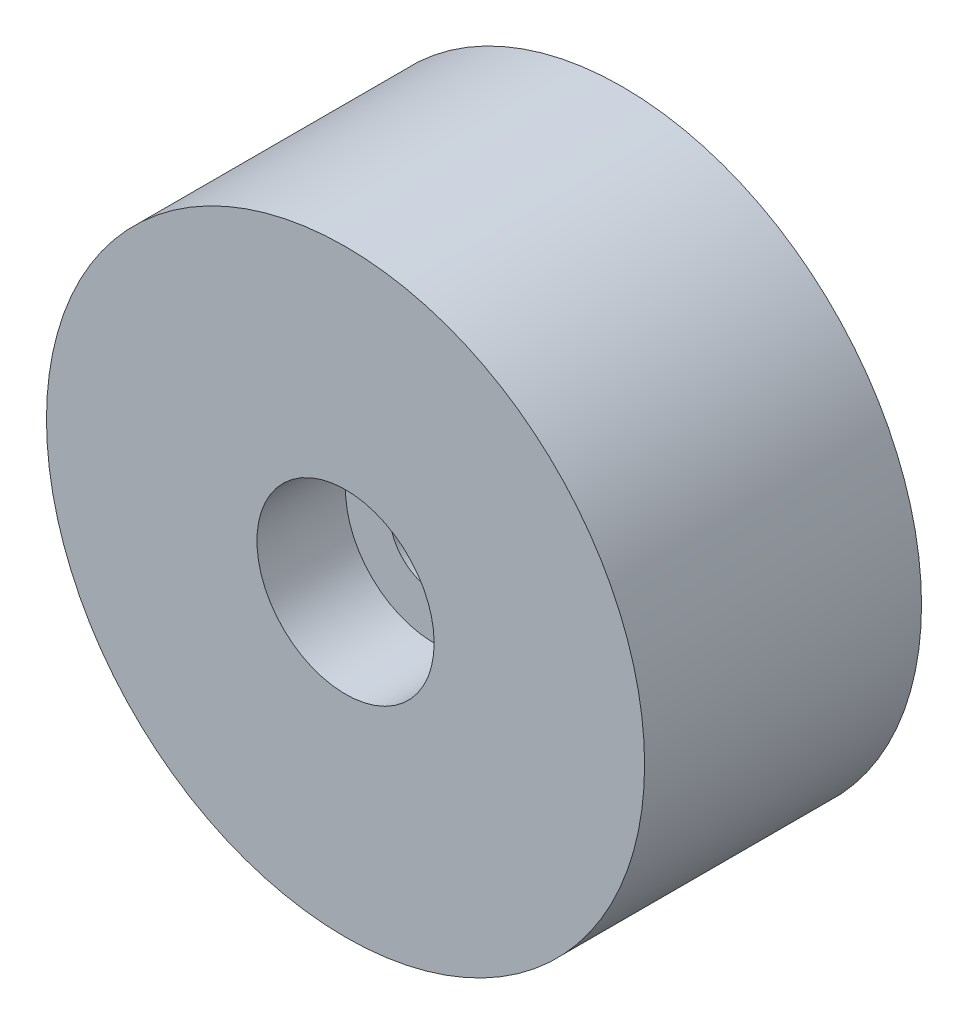
ISO-10303-21;
HEADER;
FILE_DESCRIPTION(('STEP AP214'),'2;1');
FILE_NAME('part.step','',(''),(''),'','','');
FILE_SCHEMA(('AUTOMOTIVE_DESIGN { 1 0 10303 214 1 1 1 1 }'));
ENDSEC;
DATA;
#1=APPLICATION_CONTEXT('core data for automotive mechanical design processes');
#2=APPLICATION_PROTOCOL_DEFINITION('international standard','automotive_design',2000,#1);
#3=PRODUCT_CONTEXT('',#1,'mechanical');
#4=PRODUCT('Part','Part','',(#3));
#5=PRODUCT_RELATED_PRODUCT_CATEGORY('part','',(#4));
#6=PRODUCT_DEFINITION_FORMATION('','',#4);
#7=PRODUCT_DEFINITION_CONTEXT('part definition',#1,'design');
#8=PRODUCT_DEFINITION('design','',#6,#7);
#9=PRODUCT_DEFINITION_SHAPE('','',#8);
#10=(LENGTH_UNIT() NAMED_UNIT(*) SI_UNIT(.MILLI.,.METRE.));
#11=(NAMED_UNIT(*) PLANE_ANGLE_UNIT() SI_UNIT($,.RADIAN.));
#12=(NAMED_UNIT(*) SI_UNIT($,.STERADIAN.) SOLID_ANGLE_UNIT());
#13=UNCERTAINTY_MEASURE_WITH_UNIT(LENGTH_MEASURE(1.E-05),#10,'distance_accuracy_value','');
#14=(GEOMETRIC_REPRESENTATION_CONTEXT(3) GLOBAL_UNCERTAINTY_ASSIGNED_CONTEXT((#13)) GLOBAL_UNIT_ASSIGNED_CONTEXT((#10,
#11,#12)) REPRESENTATION_CONTEXT('',''));
#15=CARTESIAN_POINT('',(0.,0.,0.));
#16=DIRECTION('',(0.,0.,1.));
#17=DIRECTION('',(1.,0.,0.));
#18=AXIS2_PLACEMENT_3D('',#15,#16,#17);
#19=CARTESIAN_POINT('',(0.,0.,25.));
#20=DIRECTION('',(0.,0.,-1.));
#21=DIRECTION('',(-1.,0.,0.));
#22=AXIS2_PLACEMENT_3D('',#19,#20,#21);
#23=CYLINDRICAL_SURFACE('',#22,27.);
#24=CARTESIAN_POINT('',(0.,0.,25.));
#25=DIRECTION('',(0.,0.,1.));
#26=DIRECTION('',(1.,0.,0.));
#27=AXIS2_PLACEMENT_3D('',#24,#25,#26);
#28=CIRCLE('',#27,27.);
#29=CARTESIAN_POINT('',(27.,0.,25.));
#30=VERTEX_POINT('',#29);
#31=EDGE_CURVE('E10',#30,#30,#28,.T.);
#32=ORIENTED_EDGE('',*,*,#31,.F.);
#33=EDGE_LOOP('',(#32));
#34=FACE_BOUND('',#33,.T.);
#35=CARTESIAN_POINT('',(0.,0.,0.));
#36=DIRECTION('',(0.,0.,1.));
#37=DIRECTION('',(1.,0.,0.));
#38=AXIS2_PLACEMENT_3D('',#35,#36,#37);
#39=CIRCLE('',#38,27.);
#40=CARTESIAN_POINT('',(27.,0.,0.));
#41=VERTEX_POINT('',#40);
#42=EDGE_CURVE('E33',#41,#41,#39,.T.);
#43=ORIENTED_EDGE('',*,*,#42,.T.);
#44=EDGE_LOOP('',(#43));
#45=FACE_BOUND('',#44,.T.);
#46=ADVANCED_FACE('F30',(#34,#45),#23,.T.);
#47=CARTESIAN_POINT('',(0.,0.,25.));
#48=DIRECTION('',(0.,0.,1.));
#49=DIRECTION('',(1.,0.,0.));
#50=AXIS2_PLACEMENT_3D('',#47,#48,#49);
#51=PLANE('',#50);
#52=CARTESIAN_POINT('',(0.,0.,25.));
#53=DIRECTION('',(0.,0.,1.));
#54=DIRECTION('',(1.,0.,0.));
#55=AXIS2_PLACEMENT_3D('',#52,#53,#54);
#56=CIRCLE('',#55,8.);
#57=CARTESIAN_POINT('',(8.,0.,25.));
#58=VERTEX_POINT('',#57);
#59=EDGE_CURVE('E42',#58,#58,#56,.T.);
#60=ORIENTED_EDGE('',*,*,#59,.F.);
#61=EDGE_LOOP('',(#60));
#62=FACE_BOUND('',#61,.T.);
#63=ORIENTED_EDGE('',*,*,#31,.T.);
#64=EDGE_LOOP('',(#63));
#65=FACE_BOUND('',#64,.T.);
#66=ADVANCED_FACE('F75',(#62,#65),#51,.T.);
#67=CARTESIAN_POINT('',(0.,0.,0.));
#68=DIRECTION('',(0.,0.,1.));
#69=DIRECTION('',(1.,0.,0.));
#70=AXIS2_PLACEMENT_3D('',#67,#68,#69);
#71=PLANE('',#70);
#72=CARTESIAN_POINT('',(0.,0.,0.));
#73=DIRECTION('',(0.,0.,1.));
#74=DIRECTION('',(1.,0.,0.));
#75=AXIS2_PLACEMENT_3D('',#72,#73,#74);
#76=CIRCLE('',#75,4.);
#77=CARTESIAN_POINT('',(4.,0.,0.));
#78=VERTEX_POINT('',#77);
#79=EDGE_CURVE('E45',#78,#78,#76,.T.);
#80=ORIENTED_EDGE('',*,*,#79,.T.);
#81=EDGE_LOOP('',(#80));
#82=FACE_BOUND('',#81,.T.);
#83=ORIENTED_EDGE('',*,*,#42,.F.);
#84=EDGE_LOOP('',(#83));
#85=FACE_BOUND('',#84,.T.);
#86=ADVANCED_FACE('F54',(#82,#85),#71,.F.);
#87=CARTESIAN_POINT('',(0.,0.,17.));
#88=DIRECTION('',(0.,0.,1.));
#89=DIRECTION('',(1.,0.,0.));
#90=AXIS2_PLACEMENT_3D('',#87,#88,#89);
#91=CYLINDRICAL_SURFACE('',#90,8.);
#92=CARTESIAN_POINT('',(0.,0.,17.));
#93=DIRECTION('',(0.,0.,1.));
#94=DIRECTION('',(1.,0.,0.));
#95=AXIS2_PLACEMENT_3D('',#92,#93,#94);
#96=CIRCLE('',#95,8.);
#97=CARTESIAN_POINT('',(8.,0.,17.));
#98=VERTEX_POINT('',#97);
#99=EDGE_CURVE('E40',#98,#98,#96,.T.);
#100=ORIENTED_EDGE('',*,*,#99,.F.);
#101=EDGE_LOOP('',(#100));
#102=FACE_BOUND('',#101,.T.);
#103=ORIENTED_EDGE('',*,*,#59,.T.);
#104=EDGE_LOOP('',(#103));
#105=FACE_BOUND('',#104,.T.);
#106=ADVANCED_FACE('F66',(#102,#105),#91,.F.);
#107=CARTESIAN_POINT('',(0.,0.,17.));
#108=DIRECTION('',(0.,0.,1.));
#109=DIRECTION('',(1.,0.,0.));
#110=AXIS2_PLACEMENT_3D('',#107,#108,#109);
#111=PLANE('',#110);
#112=CARTESIAN_POINT('',(0.,0.,17.));
#113=DIRECTION('',(0.,0.,1.));
#114=DIRECTION('',(1.,0.,0.));
#115=AXIS2_PLACEMENT_3D('',#112,#113,#114);
#116=CIRCLE('',#115,4.);
#117=CARTESIAN_POINT('',(4.,0.,17.));
#118=VERTEX_POINT('',#117);
#119=EDGE_CURVE('E48',#118,#118,#116,.T.);
#120=ORIENTED_EDGE('',*,*,#119,.F.);
#121=EDGE_LOOP('',(#120));
#122=FACE_BOUND('',#121,.T.);
#123=ORIENTED_EDGE('',*,*,#99,.T.);
#124=EDGE_LOOP('',(#123));
#125=FACE_BOUND('',#124,.T.);
#126=ADVANCED_FACE('F60',(#122,#125),#111,.T.);
#127=CARTESIAN_POINT('',(0.,0.,0.));
#128=DIRECTION('',(0.,0.,1.));
#129=DIRECTION('',(1.,0.,0.));
#130=AXIS2_PLACEMENT_3D('',#127,#128,#129);
#131=CYLINDRICAL_SURFACE('',#130,4.);
#132=ORIENTED_EDGE('',*,*,#79,.F.);
#133=EDGE_LOOP('',(#132));
#134=FACE_BOUND('',#133,.T.);
#135=ORIENTED_EDGE('',*,*,#119,.T.);
#136=EDGE_LOOP('',(#135));
#137=FACE_BOUND('',#136,.T.);
#138=ADVANCED_FACE('F57',(#134,#137),#131,.F.);
#139=CLOSED_SHELL('',(#46,#66,#86,#106,#126,#138));
#140=MANIFOLD_SOLID_BREP('B2',#139);
#141=ADVANCED_BREP_SHAPE_REPRESENTATION('',(#18,#140),#14);
#142=SHAPE_DEFINITION_REPRESENTATION(#9,#141);
ENDSEC;
END-ISO-10303-21;
